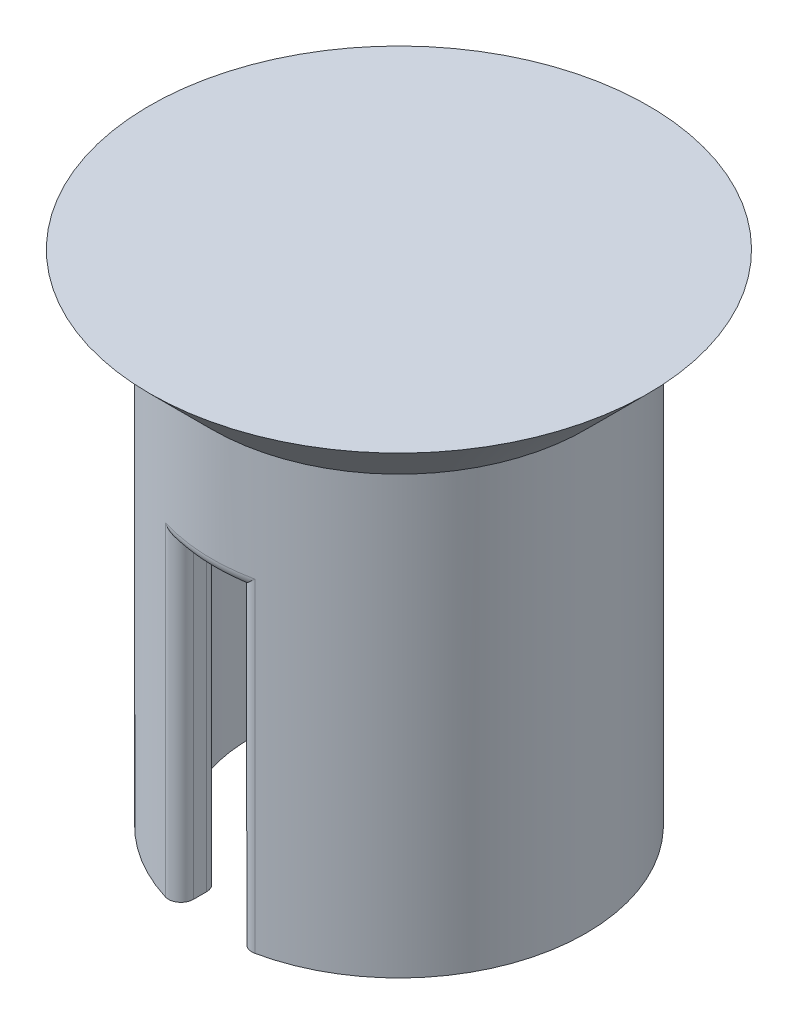
ISO-10303-21;
HEADER;
FILE_DESCRIPTION(('STEP AP214'),'2;1');
FILE_NAME('part.step','',(''),(''),'','','');
FILE_SCHEMA(('AUTOMOTIVE_DESIGN { 1 0 10303 214 1 1 1 1 }'));
ENDSEC;
DATA;
#1=APPLICATION_CONTEXT('core data for automotive mechanical design processes');
#2=APPLICATION_PROTOCOL_DEFINITION('international standard','automotive_design',2000,#1);
#3=PRODUCT_CONTEXT('',#1,'mechanical');
#4=PRODUCT('Part','Part','',(#3));
#5=PRODUCT_RELATED_PRODUCT_CATEGORY('part','',(#4));
#6=PRODUCT_DEFINITION_FORMATION('','',#4);
#7=PRODUCT_DEFINITION_CONTEXT('part definition',#1,'design');
#8=PRODUCT_DEFINITION('design','',#6,#7);
#9=PRODUCT_DEFINITION_SHAPE('','',#8);
#10=(LENGTH_UNIT() NAMED_UNIT(*) SI_UNIT(.MILLI.,.METRE.));
#11=(NAMED_UNIT(*) PLANE_ANGLE_UNIT() SI_UNIT($,.RADIAN.));
#12=(NAMED_UNIT(*) SI_UNIT($,.STERADIAN.) SOLID_ANGLE_UNIT());
#13=UNCERTAINTY_MEASURE_WITH_UNIT(LENGTH_MEASURE(1.E-05),#10,'distance_accuracy_value','');
#14=(GEOMETRIC_REPRESENTATION_CONTEXT(3) GLOBAL_UNCERTAINTY_ASSIGNED_CONTEXT((#13)) GLOBAL_UNIT_ASSIGNED_CONTEXT((#10,
#11,#12)) REPRESENTATION_CONTEXT('',''));
#15=CARTESIAN_POINT('',(0.,0.,0.));
#16=DIRECTION('',(0.,0.,1.));
#17=DIRECTION('',(1.,0.,0.));
#18=AXIS2_PLACEMENT_3D('',#15,#16,#17);
#19=CARTESIAN_POINT('',(0.,0.,0.));
#20=DIRECTION('',(0.,1.,0.));
#21=DIRECTION('',(0.,0.,1.));
#22=AXIS2_PLACEMENT_3D('',#19,#20,#21);
#23=PLANE('',#22);
#24=DIRECTION('',(0.,0.,1.));
#25=VECTOR('',#24,1.);
#26=CARTESIAN_POINT('',(1.90109957926324,0.,-10.3720131622978));
#27=LINE('',#26,#25);
#28=CARTESIAN_POINT('',(1.90109957926324,0.,-13.6961170129055));
#29=VERTEX_POINT('',#28);
#30=CARTESIAN_POINT('',(1.90109957926324,0.,-12.6721592963156));
#31=VERTEX_POINT('',#30);
#32=EDGE_CURVE('E290',#29,#31,#27,.T.);
#33=ORIENTED_EDGE('',*,*,#32,.F.);
#34=CARTESIAN_POINT('',(2.90109957926324,0.,-13.6961170129055));
#35=DIRECTION('',(0.,1.,0.));
#36=DIRECTION('',(0.,0.,1.));
#37=AXIS2_PLACEMENT_3D('',#34,#35,#36);
#38=CIRCLE('',#37,1.);
#39=CARTESIAN_POINT('',(3.10832097778204,0.,-14.6744110852559));
#40=VERTEX_POINT('',#39);
#41=EDGE_CURVE('E196',#29,#40,#38,.F.);
#42=ORIENTED_EDGE('',*,*,#41,.T.);
#43=CARTESIAN_POINT('',(0.,0.,0.));
#44=DIRECTION('',(0.,1.,0.));
#45=DIRECTION('',(0.,0.,1.));
#46=AXIS2_PLACEMENT_3D('',#43,#44,#45);
#47=CIRCLE('',#46,15.);
#48=CARTESIAN_POINT('',(3.10832097778175,0.,14.6744110852559));
#49=VERTEX_POINT('',#48);
#50=EDGE_CURVE('E302',#49,#40,#47,.T.);
#51=ORIENTED_EDGE('',*,*,#50,.F.);
#52=CARTESIAN_POINT('',(2.90109957926297,0.,13.6961170129055));
#53=DIRECTION('',(0.,1.,0.));
#54=DIRECTION('',(0.,0.,1.));
#55=AXIS2_PLACEMENT_3D('',#52,#53,#54);
#56=CIRCLE('',#55,1.);
#57=CARTESIAN_POINT('',(1.90109957926297,0.,13.6961170129055));
#58=VERTEX_POINT('',#57);
#59=EDGE_CURVE('E341',#49,#58,#56,.F.);
#60=ORIENTED_EDGE('',*,*,#59,.T.);
#61=DIRECTION('',(0.,0.,1.));
#62=VECTOR('',#61,1.);
#63=CARTESIAN_POINT('',(1.90109957926297,0.,15.6279868377022));
#64=LINE('',#63,#62);
#65=CARTESIAN_POINT('',(1.90109957926297,0.,12.6721592963157));
#66=VERTEX_POINT('',#65);
#67=EDGE_CURVE('E284',#66,#58,#64,.T.);
#68=ORIENTED_EDGE('',*,*,#67,.F.);
#69=CARTESIAN_POINT('',(2.90109957926297,0.,12.6721592963157));
#70=DIRECTION('',(0.,1.,0.));
#71=DIRECTION('',(0.,0.,1.));
#72=AXIS2_PLACEMENT_3D('',#69,#70,#71);
#73=CIRCLE('',#72,1.);
#74=CARTESIAN_POINT('',(2.67793807316581,0.,11.6973778119837));
#75=VERTEX_POINT('',#74);
#76=EDGE_CURVE('E343',#66,#75,#73,.F.);
#77=ORIENTED_EDGE('',*,*,#76,.T.);
#78=CARTESIAN_POINT('',(0.,0.,0.));
#79=DIRECTION('',(0.,-1.,0.));
#80=DIRECTION('',(0.,0.,-1.));
#81=AXIS2_PLACEMENT_3D('',#78,#79,#80);
#82=CIRCLE('',#81,12.);
#83=CARTESIAN_POINT('',(2.67793807316606,0.,-11.6973778119837));
#84=VERTEX_POINT('',#83);
#85=EDGE_CURVE('E298',#84,#75,#82,.T.);
#86=ORIENTED_EDGE('',*,*,#85,.F.);
#87=CARTESIAN_POINT('',(2.90109957926324,0.,-12.6721592963156));
#88=DIRECTION('',(0.,1.,0.));
#89=DIRECTION('',(0.,0.,1.));
#90=AXIS2_PLACEMENT_3D('',#87,#88,#89);
#91=CIRCLE('',#90,1.);
#92=EDGE_CURVE('E191',#84,#31,#91,.F.);
#93=ORIENTED_EDGE('',*,*,#92,.T.);
#94=EDGE_LOOP('',(#33,#42,#51,#60,#68,#77,#86,#93));
#95=FACE_BOUND('',#94,.T.);
#96=ADVANCED_FACE('F35',(#95),#23,.F.);
#97=CARTESIAN_POINT('',(0.,25.,0.));
#98=DIRECTION('',(0.,-1.,0.));
#99=DIRECTION('',(0.,0.,-1.));
#100=AXIS2_PLACEMENT_3D('',#97,#98,#99);
#101=CYLINDRICAL_SURFACE('',#100,12.);
#102=CARTESIAN_POINT('',(0.,25.,0.));
#103=DIRECTION('',(0.,-1.,0.));
#104=DIRECTION('',(0.,0.,-1.));
#105=AXIS2_PLACEMENT_3D('',#102,#103,#104);
#106=CIRCLE('',#105,12.);
#107=CARTESIAN_POINT('',(2.67793807316606,25.,-11.6973778119837));
#108=VERTEX_POINT('',#107);
#109=CARTESIAN_POINT('',(2.67793807316581,25.,11.6973778119837));
#110=VERTEX_POINT('',#109);
#111=EDGE_CURVE('E169',#108,#110,#106,.T.);
#112=ORIENTED_EDGE('',*,*,#111,.F.);
#113=DIRECTION('',(0.,-1.,0.));
#114=VECTOR('',#113,1.);
#115=CARTESIAN_POINT('',(2.67793807316606,25.,-11.6973778119837));
#116=LINE('',#115,#114);
#117=EDGE_CURVE('E183',#108,#84,#116,.T.);
#118=ORIENTED_EDGE('',*,*,#117,.T.);
#119=ORIENTED_EDGE('',*,*,#85,.T.);
#120=DIRECTION('',(0.,-1.,0.));
#121=VECTOR('',#120,1.);
#122=CARTESIAN_POINT('',(2.67793807316582,25.,11.6973778119837));
#123=LINE('',#122,#121);
#124=EDGE_CURVE('E186',#75,#110,#123,.F.);
#125=ORIENTED_EDGE('',*,*,#124,.T.);
#126=EDGE_LOOP('',(#112,#118,#119,#125));
#127=FACE_BOUND('',#126,.T.);
#128=ADVANCED_FACE('F181',(#127),#101,.F.);
#129=CARTESIAN_POINT('',(0.,30.,0.));
#130=DIRECTION('',(0.,-1.,0.));
#131=DIRECTION('',(0.,0.,-1.));
#132=AXIS2_PLACEMENT_3D('',#129,#130,#131);
#133=CYLINDRICAL_SURFACE('',#132,15.);
#134=CARTESIAN_POINT('',(0.,26.,0.));
#135=DIRECTION('',(0.,-1.,0.));
#136=DIRECTION('',(0.,0.,-1.));
#137=AXIS2_PLACEMENT_3D('',#134,#135,#136);
#138=CIRCLE('',#137,15.);
#139=CARTESIAN_POINT('',(3.10832097778204,26.,-14.6744110852559));
#140=VERTEX_POINT('',#139);
#141=CARTESIAN_POINT('',(-4.39167902221796,26.,-14.3427039070675));
#142=VERTEX_POINT('',#141);
#143=EDGE_CURVE('E315',#140,#142,#138,.F.);
#144=ORIENTED_EDGE('',*,*,#143,.T.);
#145=DIRECTION('',(0.,-1.,0.));
#146=VECTOR('',#145,1.);
#147=CARTESIAN_POINT('',(-4.39167902221796,30.,-14.3427039070676));
#148=LINE('',#147,#146);
#149=CARTESIAN_POINT('',(-4.39167902221796,0.,-14.3427039070675));
#150=VERTEX_POINT('',#149);
#151=EDGE_CURVE('E317',#142,#150,#148,.T.);
#152=ORIENTED_EDGE('',*,*,#151,.T.);
#153=CARTESIAN_POINT('',(-4.39167902221825,0.,14.3427039070675));
#154=VERTEX_POINT('',#153);
#155=EDGE_CURVE('E187',#150,#154,#47,.T.);
#156=ORIENTED_EDGE('',*,*,#155,.T.);
#157=DIRECTION('',(0.,-1.,0.));
#158=VECTOR('',#157,1.);
#159=CARTESIAN_POINT('',(-4.39167902221825,30.,14.3427039070675));
#160=LINE('',#159,#158);
#161=CARTESIAN_POINT('',(-4.39167902221825,26.,14.3427039070675));
#162=VERTEX_POINT('',#161);
#163=EDGE_CURVE('E265',#154,#162,#160,.F.);
#164=ORIENTED_EDGE('',*,*,#163,.T.);
#165=CARTESIAN_POINT('',(0.,26.,0.));
#166=DIRECTION('',(0.,-1.,0.));
#167=DIRECTION('',(0.,0.,-1.));
#168=AXIS2_PLACEMENT_3D('',#165,#166,#167);
#169=CIRCLE('',#168,15.);
#170=CARTESIAN_POINT('',(3.10832097778175,26.,14.6744110852559));
#171=VERTEX_POINT('',#170);
#172=EDGE_CURVE('E260',#162,#171,#169,.F.);
#173=ORIENTED_EDGE('',*,*,#172,.T.);
#174=DIRECTION('',(0.,-1.,0.));
#175=VECTOR('',#174,1.);
#176=CARTESIAN_POINT('',(3.10832097778175,30.,14.6744110852559));
#177=LINE('',#176,#175);
#178=EDGE_CURVE('E309',#171,#49,#177,.T.);
#179=ORIENTED_EDGE('',*,*,#178,.T.);
#180=ORIENTED_EDGE('',*,*,#50,.T.);
#181=DIRECTION('',(0.,-1.,0.));
#182=VECTOR('',#181,1.);
#183=CARTESIAN_POINT('',(3.10832097778204,30.,-14.6744110852559));
#184=LINE('',#183,#182);
#185=EDGE_CURVE('E313',#40,#140,#184,.F.);
#186=ORIENTED_EDGE('',*,*,#185,.T.);
#187=EDGE_LOOP('',(#144,#152,#156,#164,#173,#179,#180,#186));
#188=FACE_BOUND('',#187,.T.);
#189=CARTESIAN_POINT('',(0.,35.0000000000001,0.));
#190=DIRECTION('',(0.,1.,0.));
#191=DIRECTION('',(0.,0.,1.));
#192=AXIS2_PLACEMENT_3D('',#189,#190,#191);
#193=CIRCLE('',#192,15.);
#194=CARTESIAN_POINT('',(0.,35.0000000000001,15.));
#195=VERTEX_POINT('',#194);
#196=EDGE_CURVE('E303',#195,#195,#193,.F.);
#197=ORIENTED_EDGE('',*,*,#196,.T.);
#198=EDGE_LOOP('',(#197));
#199=FACE_BOUND('',#198,.T.);
#200=ADVANCED_FACE('F354',(#188,#199),#133,.T.);
#201=ORIENTED_EDGE('',*,*,#155,.F.);
#202=CARTESIAN_POINT('',(-4.09890042073676,0.,-13.3865236465964));
#203=DIRECTION('',(0.,1.,0.));
#204=DIRECTION('',(0.,0.,1.));
#205=AXIS2_PLACEMENT_3D('',#202,#203,#204);
#206=CIRCLE('',#205,1.);
#207=CARTESIAN_POINT('',(-3.09890042073676,0.,-13.3865236465964));
#208=VERTEX_POINT('',#207);
#209=EDGE_CURVE('E325',#150,#208,#206,.F.);
#210=ORIENTED_EDGE('',*,*,#209,.T.);
#211=DIRECTION('',(0.,0.,-1.));
#212=VECTOR('',#211,1.);
#213=CARTESIAN_POINT('',(-3.09890042073676,0.,-10.3720131622978));
#214=LINE('',#213,#212);
#215=CARTESIAN_POINT('',(-3.09890042073676,0.,-12.336896503614));
#216=VERTEX_POINT('',#215);
#217=EDGE_CURVE('E292',#216,#208,#214,.T.);
#218=ORIENTED_EDGE('',*,*,#217,.F.);
#219=CARTESIAN_POINT('',(-4.09890042073676,0.,-12.336896503614));
#220=DIRECTION('',(0.,1.,0.));
#221=DIRECTION('',(0.,0.,1.));
#222=AXIS2_PLACEMENT_3D('',#219,#220,#221);
#223=CIRCLE('',#222,1.);
#224=CARTESIAN_POINT('',(-3.7836003883724,0.,-11.3879044648745));
#225=VERTEX_POINT('',#224);
#226=EDGE_CURVE('E323',#216,#225,#223,.F.);
#227=ORIENTED_EDGE('',*,*,#226,.T.);
#228=CARTESIAN_POINT('',(-3.78360038837265,0.,11.3879044648744));
#229=VERTEX_POINT('',#228);
#230=EDGE_CURVE('E278',#229,#225,#82,.T.);
#231=ORIENTED_EDGE('',*,*,#230,.F.);
#232=CARTESIAN_POINT('',(-4.09890042073703,0.,12.3368965036139));
#233=DIRECTION('',(0.,1.,0.));
#234=DIRECTION('',(0.,0.,1.));
#235=AXIS2_PLACEMENT_3D('',#232,#233,#234);
#236=CIRCLE('',#235,1.);
#237=CARTESIAN_POINT('',(-3.09890042073703,0.,12.3368965036139));
#238=VERTEX_POINT('',#237);
#239=EDGE_CURVE('E321',#229,#238,#236,.F.);
#240=ORIENTED_EDGE('',*,*,#239,.T.);
#241=DIRECTION('',(0.,0.,-1.));
#242=VECTOR('',#241,1.);
#243=CARTESIAN_POINT('',(-3.09890042073703,0.,15.6279868377022));
#244=LINE('',#243,#242);
#245=CARTESIAN_POINT('',(-3.09890042073703,0.,13.3865236465963));
#246=VERTEX_POINT('',#245);
#247=EDGE_CURVE('E281',#246,#238,#244,.T.);
#248=ORIENTED_EDGE('',*,*,#247,.F.);
#249=CARTESIAN_POINT('',(-4.09890042073703,0.,13.3865236465963));
#250=DIRECTION('',(0.,1.,0.));
#251=DIRECTION('',(0.,0.,1.));
#252=AXIS2_PLACEMENT_3D('',#249,#250,#251);
#253=CIRCLE('',#252,1.);
#254=EDGE_CURVE('E319',#246,#154,#253,.F.);
#255=ORIENTED_EDGE('',*,*,#254,.T.);
#256=EDGE_LOOP('',(#201,#210,#218,#227,#231,#240,#248,#255));
#257=FACE_BOUND('',#256,.T.);
#258=ADVANCED_FACE('F369',(#257),#23,.F.);
#259=ORIENTED_EDGE('',*,*,#230,.T.);
#260=DIRECTION('',(0.,-1.,0.));
#261=VECTOR('',#260,1.);
#262=CARTESIAN_POINT('',(-3.7836003883724,25.,-11.3879044648745));
#263=LINE('',#262,#261);
#264=CARTESIAN_POINT('',(-3.7836003883724,25.,-11.3879044648745));
#265=VERTEX_POINT('',#264);
#266=EDGE_CURVE('E334',#225,#265,#263,.F.);
#267=ORIENTED_EDGE('',*,*,#266,.T.);
#268=CARTESIAN_POINT('',(-3.78360038837265,25.,11.3879044648744));
#269=VERTEX_POINT('',#268);
#270=EDGE_CURVE('E188',#269,#265,#106,.T.);
#271=ORIENTED_EDGE('',*,*,#270,.F.);
#272=DIRECTION('',(0.,-1.,0.));
#273=VECTOR('',#272,1.);
#274=CARTESIAN_POINT('',(-3.78360038837265,25.,11.3879044648744));
#275=LINE('',#274,#273);
#276=EDGE_CURVE('E331',#269,#229,#275,.T.);
#277=ORIENTED_EDGE('',*,*,#276,.T.);
#278=EDGE_LOOP('',(#259,#267,#271,#277));
#279=FACE_BOUND('',#278,.T.);
#280=ADVANCED_FACE('F381',(#279),#101,.F.);
#281=CARTESIAN_POINT('',(0.,25.,0.));
#282=DIRECTION('',(0.,-1.,0.));
#283=DIRECTION('',(0.,0.,-1.));
#284=AXIS2_PLACEMENT_3D('',#281,#282,#283);
#285=PLANE('',#284);
#286=DIRECTION('',(0.,0.,-1.));
#287=VECTOR('',#286,1.);
#288=CARTESIAN_POINT('',(-3.09890042073676,25.,-10.3720131622978));
#289=LINE('',#288,#287);
#290=CARTESIAN_POINT('',(-3.09890042073676,25.,-12.336896503614));
#291=VERTEX_POINT('',#290);
#292=CARTESIAN_POINT('',(-3.09890042073676,25.,-13.3865236465964));
#293=VERTEX_POINT('',#292);
#294=EDGE_CURVE('E288',#291,#293,#289,.T.);
#295=ORIENTED_EDGE('',*,*,#294,.T.);
#296=CARTESIAN_POINT('',(-4.09890042073676,25.,-13.3865236465964));
#297=DIRECTION('',(0.,-1.,0.));
#298=DIRECTION('',(0.,0.,-1.));
#299=AXIS2_PLACEMENT_3D('',#296,#297,#298);
#300=CIRCLE('',#299,1.);
#301=CARTESIAN_POINT('',(-3.13287378505931,25.,-13.6449661724347));
#302=VERTEX_POINT('',#301);
#303=EDGE_CURVE('E205',#293,#302,#300,.F.);
#304=ORIENTED_EDGE('',*,*,#303,.T.);
#305=CARTESIAN_POINT('',(0.,25.,0.));
#306=DIRECTION('',(0.,-1.,0.));
#307=DIRECTION('',(0.,0.,-1.));
#308=AXIS2_PLACEMENT_3D('',#305,#306,#307);
#309=CIRCLE('',#308,14.);
#310=CARTESIAN_POINT('',(1.91602885379449,25.,-13.868267138739));
#311=VERTEX_POINT('',#310);
#312=EDGE_CURVE('E307',#302,#311,#309,.T.);
#313=ORIENTED_EDGE('',*,*,#312,.T.);
#314=CARTESIAN_POINT('',(2.90109957926324,25.,-13.6961170129055));
#315=DIRECTION('',(0.,-1.,0.));
#316=DIRECTION('',(0.,0.,-1.));
#317=AXIS2_PLACEMENT_3D('',#314,#315,#316);
#318=CIRCLE('',#317,1.);
#319=CARTESIAN_POINT('',(1.90109957926324,25.,-13.6961170129055));
#320=VERTEX_POINT('',#319);
#321=EDGE_CURVE('E176',#311,#320,#318,.F.);
#322=ORIENTED_EDGE('',*,*,#321,.T.);
#323=DIRECTION('',(0.,0.,1.));
#324=VECTOR('',#323,1.);
#325=CARTESIAN_POINT('',(1.90109957926324,25.,-10.3720131622978));
#326=LINE('',#325,#324);
#327=CARTESIAN_POINT('',(1.90109957926324,25.,-12.6721592963156));
#328=VERTEX_POINT('',#327);
#329=EDGE_CURVE('E171',#320,#328,#326,.T.);
#330=ORIENTED_EDGE('',*,*,#329,.T.);
#331=CARTESIAN_POINT('',(2.90109957926324,25.,-12.6721592963156));
#332=DIRECTION('',(0.,-1.,0.));
#333=DIRECTION('',(0.,0.,-1.));
#334=AXIS2_PLACEMENT_3D('',#331,#332,#333);
#335=CIRCLE('',#334,1.);
#336=EDGE_CURVE('E165',#328,#108,#335,.F.);
#337=ORIENTED_EDGE('',*,*,#336,.T.);
#338=ORIENTED_EDGE('',*,*,#111,.T.);
#339=CARTESIAN_POINT('',(2.90109957926297,25.,12.6721592963157));
#340=DIRECTION('',(0.,-1.,0.));
#341=DIRECTION('',(0.,0.,-1.));
#342=AXIS2_PLACEMENT_3D('',#339,#340,#341);
#343=CIRCLE('',#342,1.);
#344=CARTESIAN_POINT('',(1.90109957926297,25.,12.6721592963157));
#345=VERTEX_POINT('',#344);
#346=EDGE_CURVE('E50',#110,#345,#343,.F.);
#347=ORIENTED_EDGE('',*,*,#346,.T.);
#348=DIRECTION('',(0.,0.,1.));
#349=VECTOR('',#348,1.);
#350=CARTESIAN_POINT('',(1.90109957926297,25.,15.6279868377022));
#351=LINE('',#350,#349);
#352=CARTESIAN_POINT('',(1.90109957926297,25.,13.6961170129055));
#353=VERTEX_POINT('',#352);
#354=EDGE_CURVE('E275',#345,#353,#351,.T.);
#355=ORIENTED_EDGE('',*,*,#354,.T.);
#356=CARTESIAN_POINT('',(2.90109957926297,25.,13.6961170129055));
#357=DIRECTION('',(0.,-1.,0.));
#358=DIRECTION('',(0.,0.,-1.));
#359=AXIS2_PLACEMENT_3D('',#356,#357,#358);
#360=CIRCLE('',#359,1.);
#361=CARTESIAN_POINT('',(1.91602885379422,25.,13.868267138739));
#362=VERTEX_POINT('',#361);
#363=EDGE_CURVE('E11',#353,#362,#360,.F.);
#364=ORIENTED_EDGE('',*,*,#363,.T.);
#365=CARTESIAN_POINT('',(0.,25.,0.));
#366=DIRECTION('',(0.,-1.,0.));
#367=DIRECTION('',(0.,0.,-1.));
#368=AXIS2_PLACEMENT_3D('',#365,#366,#367);
#369=CIRCLE('',#368,14.);
#370=CARTESIAN_POINT('',(-3.13287378505959,25.,13.6449661724347));
#371=VERTEX_POINT('',#370);
#372=EDGE_CURVE('E57',#362,#371,#369,.T.);
#373=ORIENTED_EDGE('',*,*,#372,.T.);
#374=CARTESIAN_POINT('',(-4.09890042073703,25.,13.3865236465963));
#375=DIRECTION('',(0.,-1.,0.));
#376=DIRECTION('',(0.,0.,-1.));
#377=AXIS2_PLACEMENT_3D('',#374,#375,#376);
#378=CIRCLE('',#377,1.);
#379=CARTESIAN_POINT('',(-3.09890042073703,25.,13.3865236465963));
#380=VERTEX_POINT('',#379);
#381=EDGE_CURVE('E212',#371,#380,#378,.F.);
#382=ORIENTED_EDGE('',*,*,#381,.T.);
#383=DIRECTION('',(0.,0.,-1.));
#384=VECTOR('',#383,1.);
#385=CARTESIAN_POINT('',(-3.09890042073703,25.,15.6279868377022));
#386=LINE('',#385,#384);
#387=CARTESIAN_POINT('',(-3.09890042073703,25.,12.3368965036139));
#388=VERTEX_POINT('',#387);
#389=EDGE_CURVE('E268',#380,#388,#386,.T.);
#390=ORIENTED_EDGE('',*,*,#389,.T.);
#391=CARTESIAN_POINT('',(-4.09890042073703,25.,12.3368965036139));
#392=DIRECTION('',(0.,-1.,0.));
#393=DIRECTION('',(0.,0.,-1.));
#394=AXIS2_PLACEMENT_3D('',#391,#392,#393);
#395=CIRCLE('',#394,1.);
#396=EDGE_CURVE('E175',#388,#269,#395,.F.);
#397=ORIENTED_EDGE('',*,*,#396,.T.);
#398=ORIENTED_EDGE('',*,*,#270,.T.);
#399=CARTESIAN_POINT('',(-4.09890042073676,25.,-12.336896503614));
#400=DIRECTION('',(0.,-1.,0.));
#401=DIRECTION('',(0.,0.,-1.));
#402=AXIS2_PLACEMENT_3D('',#399,#400,#401);
#403=CIRCLE('',#402,1.);
#404=EDGE_CURVE('E208',#265,#291,#403,.F.);
#405=ORIENTED_EDGE('',*,*,#404,.T.);
#406=EDGE_LOOP('',(#295,#304,#313,#322,#330,#337,#338,#347,#355,#364,#373,#382,#390,#397,#398,#405));
#407=FACE_BOUND('',#406,.T.);
#408=ADVANCED_FACE('F168',(#407),#285,.T.);
#409=CARTESIAN_POINT('',(0.,40.,0.));
#410=DIRECTION('',(0.,1.,0.));
#411=DIRECTION('',(0.,0.,1.));
#412=AXIS2_PLACEMENT_3D('',#409,#410,#411);
#413=PLANE('',#412);
#414=CARTESIAN_POINT('',(0.,40.,0.));
#415=DIRECTION('',(0.,1.,0.));
#416=DIRECTION('',(0.,0.,1.));
#417=AXIS2_PLACEMENT_3D('',#414,#415,#416);
#418=CIRCLE('',#417,20.);
#419=CARTESIAN_POINT('',(0.,40.,20.));
#420=VERTEX_POINT('',#419);
#421=EDGE_CURVE('E274',#420,#420,#418,.T.);
#422=ORIENTED_EDGE('',*,*,#421,.T.);
#423=EDGE_LOOP('',(#422));
#424=FACE_BOUND('',#423,.T.);
#425=ADVANCED_FACE('F397',(#424),#413,.T.);
#426=CARTESIAN_POINT('',(0.,40.0000000000002,0.));
#427=DIRECTION('',(0.,1.,0.));
#428=DIRECTION('',(0.,0.,1.));
#429=AXIS2_PLACEMENT_3D('',#426,#427,#428);
#430=CONICAL_SURFACE('',#429,20.,0.785398163397443);
#431=ORIENTED_EDGE('',*,*,#196,.F.);
#432=EDGE_LOOP('',(#431));
#433=FACE_BOUND('',#432,.T.);
#434=ORIENTED_EDGE('',*,*,#421,.F.);
#435=EDGE_LOOP('',(#434));
#436=FACE_BOUND('',#435,.T.);
#437=ADVANCED_FACE('F389',(#433,#436),#430,.T.);
#438=CARTESIAN_POINT('',(1.90109957926324,25.,-10.3720131622978));
#439=DIRECTION('',(1.,0.,0.));
#440=DIRECTION('',(0.,0.,-1.));
#441=AXIS2_PLACEMENT_3D('',#438,#439,#440);
#442=PLANE('',#441);
#443=ORIENTED_EDGE('',*,*,#329,.F.);
#444=DIRECTION('',(0.,-1.,0.));
#445=VECTOR('',#444,1.);
#446=CARTESIAN_POINT('',(1.90109957926324,25.,-13.6961170129055));
#447=LINE('',#446,#445);
#448=EDGE_CURVE('E339',#320,#29,#447,.T.);
#449=ORIENTED_EDGE('',*,*,#448,.T.);
#450=ORIENTED_EDGE('',*,*,#32,.T.);
#451=DIRECTION('',(0.,-1.,0.));
#452=VECTOR('',#451,1.);
#453=CARTESIAN_POINT('',(1.90109957926324,25.,-12.6721592963156));
#454=LINE('',#453,#452);
#455=EDGE_CURVE('E337',#31,#328,#454,.F.);
#456=ORIENTED_EDGE('',*,*,#455,.T.);
#457=EDGE_LOOP('',(#443,#449,#450,#456));
#458=FACE_BOUND('',#457,.T.);
#459=ADVANCED_FACE('F387',(#458),#442,.F.);
#460=CARTESIAN_POINT('',(-3.09890042073676,25.,-10.3720131622978));
#461=DIRECTION('',(-1.,0.,0.));
#462=DIRECTION('',(0.,0.,1.));
#463=AXIS2_PLACEMENT_3D('',#460,#461,#462);
#464=PLANE('',#463);
#465=ORIENTED_EDGE('',*,*,#217,.T.);
#466=DIRECTION('',(0.,-1.,0.));
#467=VECTOR('',#466,1.);
#468=CARTESIAN_POINT('',(-3.09890042073676,25.,-13.3865236465964));
#469=LINE('',#468,#467);
#470=EDGE_CURVE('E329',#208,#293,#469,.F.);
#471=ORIENTED_EDGE('',*,*,#470,.T.);
#472=ORIENTED_EDGE('',*,*,#294,.F.);
#473=DIRECTION('',(0.,-1.,0.));
#474=VECTOR('',#473,1.);
#475=CARTESIAN_POINT('',(-3.09890042073676,25.,-12.336896503614));
#476=LINE('',#475,#474);
#477=EDGE_CURVE('E327',#291,#216,#476,.T.);
#478=ORIENTED_EDGE('',*,*,#477,.T.);
#479=EDGE_LOOP('',(#465,#471,#472,#478));
#480=FACE_BOUND('',#479,.T.);
#481=ADVANCED_FACE('F372',(#480),#464,.F.);
#482=CARTESIAN_POINT('',(1.90109957926297,25.,15.6279868377022));
#483=DIRECTION('',(1.,0.,0.));
#484=DIRECTION('',(0.,0.,-1.));
#485=AXIS2_PLACEMENT_3D('',#482,#483,#484);
#486=PLANE('',#485);
#487=ORIENTED_EDGE('',*,*,#354,.F.);
#488=DIRECTION('',(0.,-1.,0.));
#489=VECTOR('',#488,1.);
#490=CARTESIAN_POINT('',(1.90109957926297,25.,12.6721592963157));
#491=LINE('',#490,#489);
#492=EDGE_CURVE('E203',#345,#66,#491,.T.);
#493=ORIENTED_EDGE('',*,*,#492,.T.);
#494=ORIENTED_EDGE('',*,*,#67,.T.);
#495=DIRECTION('',(0.,-1.,0.));
#496=VECTOR('',#495,1.);
#497=CARTESIAN_POINT('',(1.90109957926297,25.,13.6961170129055));
#498=LINE('',#497,#496);
#499=EDGE_CURVE('E201',#58,#353,#498,.F.);
#500=ORIENTED_EDGE('',*,*,#499,.T.);
#501=EDGE_LOOP('',(#487,#493,#494,#500));
#502=FACE_BOUND('',#501,.T.);
#503=ADVANCED_FACE('F395',(#502),#486,.F.);
#504=CARTESIAN_POINT('',(-3.09890042073703,25.,15.6279868377022));
#505=DIRECTION('',(-1.,0.,0.));
#506=DIRECTION('',(0.,0.,1.));
#507=AXIS2_PLACEMENT_3D('',#504,#505,#506);
#508=PLANE('',#507);
#509=ORIENTED_EDGE('',*,*,#247,.T.);
#510=DIRECTION('',(0.,-1.,0.));
#511=VECTOR('',#510,1.);
#512=CARTESIAN_POINT('',(-3.09890042073703,25.,12.3368965036139));
#513=LINE('',#512,#511);
#514=EDGE_CURVE('E194',#238,#388,#513,.F.);
#515=ORIENTED_EDGE('',*,*,#514,.T.);
#516=ORIENTED_EDGE('',*,*,#389,.F.);
#517=DIRECTION('',(0.,-1.,0.));
#518=VECTOR('',#517,1.);
#519=CARTESIAN_POINT('',(-3.09890042073703,25.,13.3865236465963));
#520=LINE('',#519,#518);
#521=EDGE_CURVE('E192',#380,#246,#520,.T.);
#522=ORIENTED_EDGE('',*,*,#521,.T.);
#523=EDGE_LOOP('',(#509,#515,#516,#522));
#524=FACE_BOUND('',#523,.T.);
#525=ADVANCED_FACE('F241',(#524),#508,.F.);
#526=CARTESIAN_POINT('',(-4.09890042073676,30.,-13.3865236465964));
#527=DIRECTION('',(0.,-1.,0.));
#528=DIRECTION('',(0.,0.,-1.));
#529=AXIS2_PLACEMENT_3D('',#526,#527,#528);
#530=CYLINDRICAL_SURFACE('',#529,1.);
#531=ORIENTED_EDGE('',*,*,#209,.F.);
#532=ORIENTED_EDGE('',*,*,#151,.F.);
#533=CARTESIAN_POINT('',(-3.13287378505931,25.,-13.6449661724347));
#534=CARTESIAN_POINT('',(-3.13871529235119,24.9999969700503,-13.6668129872134));
#535=CARTESIAN_POINT('',(-3.14530065453778,25.0007667526437,-13.6884455921833));
#536=CARTESIAN_POINT('',(-3.15987417492568,25.0038052496297,-13.7311052049034));
#537=CARTESIAN_POINT('',(-3.16786114079447,25.006072694469,-13.7521327098497));
#538=CARTESIAN_POINT('',(-3.19365093930961,25.0149971503066,-13.8137077994765));
#539=CARTESIAN_POINT('',(-3.21339597464858,25.0237782169135,-13.8531654943376));
#540=CARTESIAN_POINT('',(-3.25703037991061,25.0462648756549,-13.9279380268948));
#541=CARTESIAN_POINT('',(-3.28090705294988,25.0599555145723,-13.9632650169836));
#542=CARTESIAN_POINT('',(-3.33191613514316,25.091430534136,-14.0295551458945));
#543=CARTESIAN_POINT('',(-3.35905604444159,25.1092244351453,-14.0605078619158));
#544=CARTESIAN_POINT('',(-3.42718406376491,25.1559633840179,-14.1294951750411));
#545=CARTESIAN_POINT('',(-3.46932401819019,25.1865039728958,-14.1653097512254));
#546=CARTESIAN_POINT('',(-3.55637699768923,25.252169021299,-14.2282874591206));
#547=CARTESIAN_POINT('',(-3.60129476544572,25.287301441233,-14.2554352780581));
#548=CARTESIAN_POINT('',(-3.70884556329342,25.3738784963262,-14.3099263654093));
#549=CARTESIAN_POINT('',(-3.77209209010412,25.4266774702759,-14.3338980198285));
#550=CARTESIAN_POINT('',(-3.89905871266604,25.5358934012387,-14.3685636287139));
#551=CARTESIAN_POINT('',(-3.96277931690028,25.5923149693603,-14.3792402933055));
#552=CARTESIAN_POINT('',(-4.08798316859403,25.7061471218296,-14.3883949645358));
#553=CARTESIAN_POINT('',(-4.14948598782439,25.7635198309139,-14.3870960194328));
#554=CARTESIAN_POINT('',(-4.2702621702653,25.8790993160157,-14.3735979783253));
#555=CARTESIAN_POINT('',(-4.32954011890223,25.937303991429,-14.3614227481491));
#556=CARTESIAN_POINT('',(-4.38867669920975,25.9969676493609,-14.3436193397283));
#557=CARTESIAN_POINT('',(-4.39017842502231,25.9984838488932,-14.343163380722));
#558=CARTESIAN_POINT('',(-4.39167902221796,26.,-14.3427039070675));
#559=B_SPLINE_CURVE_WITH_KNOTS('',3,(#533,#534,#535,#536,#537,#538,#539,#540,#541,#542,#543,
#544,#545,#546,#547,#548,#549,#550,#551,#552,#553,#554,#555,#556,#557,#558),.UNSPECIFIED.,.F.,
.F.,(4,2,2,2,2,2,2,2,2,2,2,2,4),(0.,0.0677892638747004,0.135521137096123,0.269707441452715,
0.403488474507339,0.537583085428259,0.726069137009204,0.914886393459824,1.17092839575812,
1.42730302910179,1.67891241974009,1.92997105648405,1.93651760257399),.UNSPECIFIED.);
#560=EDGE_CURVE('E224',#302,#142,#559,.T.);
#561=ORIENTED_EDGE('',*,*,#560,.F.);
#562=ORIENTED_EDGE('',*,*,#303,.F.);
#563=ORIENTED_EDGE('',*,*,#470,.F.);
#564=EDGE_LOOP('',(#531,#532,#561,#562,#563));
#565=FACE_BOUND('',#564,.T.);
#566=ADVANCED_FACE('F236',(#565),#530,.T.);
#567=CARTESIAN_POINT('',(2.90109957926324,30.,-13.6961170129055));
#568=DIRECTION('',(0.,-1.,0.));
#569=DIRECTION('',(0.,0.,-1.));
#570=AXIS2_PLACEMENT_3D('',#567,#568,#569);
#571=CYLINDRICAL_SURFACE('',#570,1.);
#572=ORIENTED_EDGE('',*,*,#448,.F.);
#573=ORIENTED_EDGE('',*,*,#321,.F.);
#574=CARTESIAN_POINT('',(1.91602885379449,25.,-13.868267138739));
#575=CARTESIAN_POINT('',(1.91991886003237,24.9999969700503,-13.8905443552367));
#576=CARTESIAN_POINT('',(1.92456872775304,25.0007667526437,-13.9126738677277));
#577=CARTESIAN_POINT('',(1.93531924562558,25.0038052496297,-13.9564535024841));
#578=CARTESIAN_POINT('',(1.9414186642067,25.006072694469,-13.9781040147419));
#579=CARTESIAN_POINT('',(1.96167175922039,25.0149971503066,-14.0417154721404));
#580=CARTESIAN_POINT('',(1.97785627322397,25.0237782169135,-14.0827622455916));
#581=CARTESIAN_POINT('',(2.0147191961798,25.0462648756549,-14.1610949836949));
#582=CARTESIAN_POINT('',(2.03538388497926,25.0599555145723,-14.1983919323768));
#583=CARTESIAN_POINT('',(2.0803415385399,25.091430534136,-14.2689264419699));
#584=CARTESIAN_POINT('',(2.1046428943125,25.1092244351453,-14.3021542829085));
#585=CARTESIAN_POINT('',(2.16641452931081,25.1559633840179,-14.3768867490714));
#586=CARTESIAN_POINT('',(2.2052281446574,25.1865039728958,-14.4162817092815));
#587=CARTESIAN_POINT('',(2.28638139012926,25.252169021299,-14.4866987788085));
#588=CARTESIAN_POINT('',(2.32872709627016,25.287301441233,-14.5177060538374));
#589=CARTESIAN_POINT('',(2.43104734637194,25.3738784963262,-14.5814792389351));
#590=CARTESIAN_POINT('',(2.49193064635049,25.4266774702759,-14.6109408606308));
#591=CARTESIAN_POINT('',(2.61534115552133,25.5358934012387,-14.6566800550961));
#592=CARTESIAN_POINT('',(2.67787039760564,25.5923149693605,-14.6729404503903));
#593=CARTESIAN_POINT('',(2.80177718956892,25.7061471218293,-14.6931126934424));
#594=CARTESIAN_POINT('',(2.86315454352908,25.7635198309131,-14.6972484464065));
#595=CARTESIAN_POINT('',(2.98465079362085,25.8790993160166,-14.6944655392925));
#596=CARTESIAN_POINT('',(3.04477215033852,25.937303991432,-14.6875710566711));
#597=CARTESIAN_POINT('',(3.10524956068905,25.996967649361,-14.6750578908246));
#598=CARTESIAN_POINT('',(3.10678567619956,25.9984838488933,-14.6747362883215));
#599=CARTESIAN_POINT('',(3.10832097778204,26.,-14.6744110852559));
#600=B_SPLINE_CURVE_WITH_KNOTS('',3,(#574,#575,#576,#577,#578,#579,#580,#581,#582,#583,#584,
#585,#586,#587,#588,#589,#590,#591,#592,#593,#594,#595,#596,#597,#598,#599),.UNSPECIFIED.,.F.,
.F.,(4,2,2,2,2,2,2,2,2,2,2,2,4),(0.,0.0677892638747022,0.135521137096125,0.269707441452712,
0.403488474507338,0.537583085428257,0.726069137009203,0.914886393459817,1.1709283957581,
1.42730302910178,1.67891241974008,1.92997105648405,1.93651760257399),.UNSPECIFIED.);
#601=EDGE_CURVE('E215',#140,#311,#600,.F.);
#602=ORIENTED_EDGE('',*,*,#601,.F.);
#603=ORIENTED_EDGE('',*,*,#185,.F.);
#604=ORIENTED_EDGE('',*,*,#41,.F.);
#605=EDGE_LOOP('',(#572,#573,#602,#603,#604));
#606=FACE_BOUND('',#605,.T.);
#607=ADVANCED_FACE('F233',(#606),#571,.T.);
#608=CARTESIAN_POINT('',(0.,26.,0.));
#609=DIRECTION('',(0.,-1.,0.));
#610=DIRECTION('',(0.,0.,-1.));
#611=AXIS2_PLACEMENT_3D('',#608,#609,#610);
#612=TOROIDAL_SURFACE('',#611,14.,1.);
#613=ORIENTED_EDGE('',*,*,#560,.T.);
#614=ORIENTED_EDGE('',*,*,#143,.F.);
#615=ORIENTED_EDGE('',*,*,#601,.T.);
#616=ORIENTED_EDGE('',*,*,#312,.F.);
#617=EDGE_LOOP('',(#613,#614,#615,#616));
#618=FACE_BOUND('',#617,.T.);
#619=ADVANCED_FACE('F230',(#618),#612,.T.);
#620=CARTESIAN_POINT('',(-4.09890042073703,30.,13.3865236465963));
#621=DIRECTION('',(0.,-1.,0.));
#622=DIRECTION('',(0.,0.,-1.));
#623=AXIS2_PLACEMENT_3D('',#620,#621,#622);
#624=CYLINDRICAL_SURFACE('',#623,1.);
#625=ORIENTED_EDGE('',*,*,#521,.F.);
#626=ORIENTED_EDGE('',*,*,#381,.F.);
#627=CARTESIAN_POINT('',(-3.13287378505959,25.,13.6449661724347));
#628=CARTESIAN_POINT('',(-3.13871529235146,24.9999969700503,13.6668129872134));
#629=CARTESIAN_POINT('',(-3.14530065453806,25.0007667526437,13.6884455921832));
#630=CARTESIAN_POINT('',(-3.15987417492596,25.0038052496297,13.7311052049034));
#631=CARTESIAN_POINT('',(-3.16786114079475,25.006072694469,13.7521327098497));
#632=CARTESIAN_POINT('',(-3.19365093930989,25.0149971503066,13.8137077994764));
#633=CARTESIAN_POINT('',(-3.21339597464886,25.0237782169135,13.8531654943375));
#634=CARTESIAN_POINT('',(-3.2570303799109,25.0462648756549,13.9279380268947));
#635=CARTESIAN_POINT('',(-3.28090705295016,25.0599555145723,13.9632650169836));
#636=CARTESIAN_POINT('',(-3.33191613514344,25.091430534136,14.0295551458944));
#637=CARTESIAN_POINT('',(-3.35905604444188,25.1092244351453,14.0605078619158));
#638=CARTESIAN_POINT('',(-3.42718406376519,25.1559633840179,14.129495175041));
#639=CARTESIAN_POINT('',(-3.46932401819049,25.1865039728958,14.1653097512253));
#640=CARTESIAN_POINT('',(-3.55637699768952,25.252169021299,14.2282874591205));
#641=CARTESIAN_POINT('',(-3.601294765446,25.2873014412331,14.255435278058));
#642=CARTESIAN_POINT('',(-3.70884556329372,25.3738784963262,14.3099263654092));
#643=CARTESIAN_POINT('',(-3.77209209010447,25.4266774702759,14.3338980198284));
#644=CARTESIAN_POINT('',(-3.89905871266627,25.5358934012387,14.3685636287138));
#645=CARTESIAN_POINT('',(-3.96277931690036,25.5923149693605,14.3792402933055));
#646=CARTESIAN_POINT('',(-4.08798316859453,25.7061471218293,14.3883949645356));
#647=CARTESIAN_POINT('',(-4.14948598782545,25.7635198309131,14.3870960194325));
#648=CARTESIAN_POINT('',(-4.27026217026483,25.8790993160166,14.3735979783254));
#649=CARTESIAN_POINT('',(-4.32954011889968,25.937303991432,14.3614227481499));
#650=CARTESIAN_POINT('',(-4.38867669920989,25.996967649361,14.3436193397282));
#651=CARTESIAN_POINT('',(-4.39017842502252,25.9984838488933,14.343163380722));
#652=CARTESIAN_POINT('',(-4.39167902221825,26.,14.3427039070675));
#653=B_SPLINE_CURVE_WITH_KNOTS('',3,(#627,#628,#629,#630,#631,#632,#633,#634,#635,#636,#637,
#638,#639,#640,#641,#642,#643,#644,#645,#646,#647,#648,#649,#650,#651,#652),.UNSPECIFIED.,.F.,
.F.,(4,2,2,2,2,2,2,2,2,2,2,2,4),(0.,0.0677892638747047,0.135521137096128,0.269707441452713,
0.403488474507339,0.53758308542826,0.726069137009208,0.914886393459827,1.17092839575811,
1.42730302910179,1.67891241974009,1.92997105648405,1.93651760257399),.UNSPECIFIED.);
#654=EDGE_CURVE('E39',#162,#371,#653,.F.);
#655=ORIENTED_EDGE('',*,*,#654,.F.);
#656=ORIENTED_EDGE('',*,*,#163,.F.);
#657=ORIENTED_EDGE('',*,*,#254,.F.);
#658=EDGE_LOOP('',(#625,#626,#655,#656,#657));
#659=FACE_BOUND('',#658,.T.);
#660=ADVANCED_FACE('F247',(#659),#624,.T.);
#661=CARTESIAN_POINT('',(2.90109957926297,30.,13.6961170129055));
#662=DIRECTION('',(0.,-1.,0.));
#663=DIRECTION('',(0.,0.,-1.));
#664=AXIS2_PLACEMENT_3D('',#661,#662,#663);
#665=CYLINDRICAL_SURFACE('',#664,1.);
#666=ORIENTED_EDGE('',*,*,#59,.F.);
#667=ORIENTED_EDGE('',*,*,#178,.F.);
#668=CARTESIAN_POINT('',(1.91602885379422,25.,13.868267138739));
#669=CARTESIAN_POINT('',(1.9199188600321,24.9999969700503,13.8905443552367));
#670=CARTESIAN_POINT('',(1.92456872775276,25.0007667526437,13.9126738677277));
#671=CARTESIAN_POINT('',(1.93531924562531,25.0038052496297,13.9564535024841));
#672=CARTESIAN_POINT('',(1.94141866420642,25.006072694469,13.978104014742));
#673=CARTESIAN_POINT('',(1.96167175922011,25.0149971503066,14.0417154721405));
#674=CARTESIAN_POINT('',(1.9778562732237,25.0237782169135,14.0827622455917));
#675=CARTESIAN_POINT('',(2.01471919617952,25.0462648756549,14.1610949836949));
#676=CARTESIAN_POINT('',(2.03538388497898,25.0599555145723,14.1983919323768));
#677=CARTESIAN_POINT('',(2.08034153853962,25.091430534136,14.2689264419699));
#678=CARTESIAN_POINT('',(2.10464289431222,25.1092244351453,14.3021542829085));
#679=CARTESIAN_POINT('',(2.16641452931053,25.1559633840179,14.3768867490714));
#680=CARTESIAN_POINT('',(2.20522814465712,25.1865039728958,14.4162817092815));
#681=CARTESIAN_POINT('',(2.28638139012897,25.252169021299,14.4866987788086));
#682=CARTESIAN_POINT('',(2.32872709626988,25.287301441233,14.5177060538374));
#683=CARTESIAN_POINT('',(2.43104734637164,25.3738784963262,14.5814792389351));
#684=CARTESIAN_POINT('',(2.49193064635017,25.4266774702759,14.6109408606308));
#685=CARTESIAN_POINT('',(2.61534115552109,25.5358934012387,14.6566800550962));
#686=CARTESIAN_POINT('',(2.67787039760551,25.5923149693603,14.6729404503904));
#687=CARTESIAN_POINT('',(2.80177718956847,25.7061471218295,14.6931126934425));
#688=CARTESIAN_POINT('',(2.8631545435282,25.7635198309137,14.6972484464067));
#689=CARTESIAN_POINT('',(2.98465079362117,25.8790993160159,14.6944655392924));
#690=CARTESIAN_POINT('',(3.04477215034046,25.9373039914296,14.6875710566707));
#691=CARTESIAN_POINT('',(3.10524956068887,25.9969676493609,14.6750578908247));
#692=CARTESIAN_POINT('',(3.10678567619933,25.9984838488932,14.6747362883215));
#693=CARTESIAN_POINT('',(3.10832097778175,26.,14.6744110852559));
#694=B_SPLINE_CURVE_WITH_KNOTS('',3,(#668,#669,#670,#671,#672,#673,#674,#675,#676,#677,#678,
#679,#680,#681,#682,#683,#684,#685,#686,#687,#688,#689,#690,#691,#692,#693),.UNSPECIFIED.,.F.,
.F.,(4,2,2,2,2,2,2,2,2,2,2,2,4),(0.,0.0677892638747038,0.135521137096126,0.269707441452712,
0.403488474507338,0.537583085428256,0.726069137009199,0.914886393459818,1.1709283957581,
1.42730302910178,1.67891241974008,1.92997105648405,1.93651760257399),.UNSPECIFIED.);
#695=EDGE_CURVE('E250',#362,#171,#694,.T.);
#696=ORIENTED_EDGE('',*,*,#695,.F.);
#697=ORIENTED_EDGE('',*,*,#363,.F.);
#698=ORIENTED_EDGE('',*,*,#499,.F.);
#699=EDGE_LOOP('',(#666,#667,#696,#697,#698));
#700=FACE_BOUND('',#699,.T.);
#701=ADVANCED_FACE('F243',(#700),#665,.T.);
#702=CARTESIAN_POINT('',(0.,26.,0.));
#703=DIRECTION('',(0.,-1.,0.));
#704=DIRECTION('',(0.,0.,-1.));
#705=AXIS2_PLACEMENT_3D('',#702,#703,#704);
#706=TOROIDAL_SURFACE('',#705,14.,1.);
#707=ORIENTED_EDGE('',*,*,#654,.T.);
#708=ORIENTED_EDGE('',*,*,#372,.F.);
#709=ORIENTED_EDGE('',*,*,#695,.T.);
#710=ORIENTED_EDGE('',*,*,#172,.F.);
#711=EDGE_LOOP('',(#707,#708,#709,#710));
#712=FACE_BOUND('',#711,.T.);
#713=ADVANCED_FACE('F246',(#712),#706,.T.);
#714=CARTESIAN_POINT('',(-4.09890042073676,25.,-12.336896503614));
#715=DIRECTION('',(0.,-1.,0.));
#716=DIRECTION('',(0.,0.,-1.));
#717=AXIS2_PLACEMENT_3D('',#714,#715,#716);
#718=CYLINDRICAL_SURFACE('',#717,1.);
#719=ORIENTED_EDGE('',*,*,#226,.F.);
#720=ORIENTED_EDGE('',*,*,#477,.F.);
#721=ORIENTED_EDGE('',*,*,#404,.F.);
#722=ORIENTED_EDGE('',*,*,#266,.F.);
#723=EDGE_LOOP('',(#719,#720,#721,#722));
#724=FACE_BOUND('',#723,.T.);
#725=ADVANCED_FACE('F376',(#724),#718,.T.);
#726=CARTESIAN_POINT('',(2.90109957926324,25.,-12.6721592963156));
#727=DIRECTION('',(0.,-1.,0.));
#728=DIRECTION('',(0.,0.,-1.));
#729=AXIS2_PLACEMENT_3D('',#726,#727,#728);
#730=CYLINDRICAL_SURFACE('',#729,1.);
#731=ORIENTED_EDGE('',*,*,#336,.F.);
#732=ORIENTED_EDGE('',*,*,#455,.F.);
#733=ORIENTED_EDGE('',*,*,#92,.F.);
#734=ORIENTED_EDGE('',*,*,#117,.F.);
#735=EDGE_LOOP('',(#731,#732,#733,#734));
#736=FACE_BOUND('',#735,.T.);
#737=ADVANCED_FACE('F190',(#736),#730,.T.);
#738=CARTESIAN_POINT('',(-4.09890042073703,25.,12.3368965036139));
#739=DIRECTION('',(0.,-1.,0.));
#740=DIRECTION('',(0.,0.,-1.));
#741=AXIS2_PLACEMENT_3D('',#738,#739,#740);
#742=CYLINDRICAL_SURFACE('',#741,1.);
#743=ORIENTED_EDGE('',*,*,#396,.F.);
#744=ORIENTED_EDGE('',*,*,#514,.F.);
#745=ORIENTED_EDGE('',*,*,#239,.F.);
#746=ORIENTED_EDGE('',*,*,#276,.F.);
#747=EDGE_LOOP('',(#743,#744,#745,#746));
#748=FACE_BOUND('',#747,.T.);
#749=ADVANCED_FACE('F385',(#748),#742,.T.);
#750=CARTESIAN_POINT('',(2.90109957926297,25.,12.6721592963157));
#751=DIRECTION('',(0.,-1.,0.));
#752=DIRECTION('',(0.,0.,-1.));
#753=AXIS2_PLACEMENT_3D('',#750,#751,#752);
#754=CYLINDRICAL_SURFACE('',#753,1.);
#755=ORIENTED_EDGE('',*,*,#76,.F.);
#756=ORIENTED_EDGE('',*,*,#492,.F.);
#757=ORIENTED_EDGE('',*,*,#346,.F.);
#758=ORIENTED_EDGE('',*,*,#124,.F.);
#759=EDGE_LOOP('',(#755,#756,#757,#758));
#760=FACE_BOUND('',#759,.T.);
#761=ADVANCED_FACE('F37',(#760),#754,.T.);
#762=CLOSED_SHELL('',(#96,#128,#200,#258,#280,#408,#425,#437,#459,#481,#503,#525,#566,#607,#619,
#660,#701,#713,#725,#737,#749,#761));
#763=MANIFOLD_SOLID_BREP('B2',#762);
#764=ADVANCED_BREP_SHAPE_REPRESENTATION('',(#18,#763),#14);
#765=SHAPE_DEFINITION_REPRESENTATION(#9,#764);
ENDSEC;
END-ISO-10303-21;
